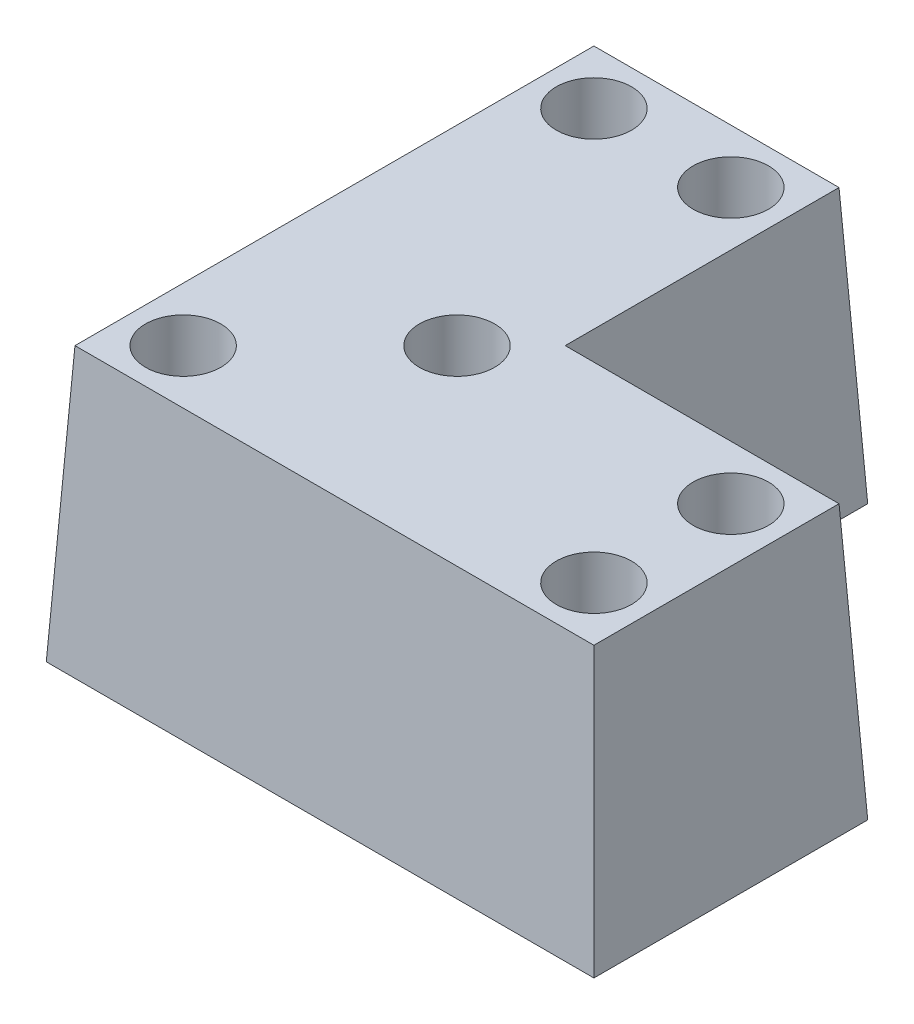
ISO-10303-21;
HEADER;
FILE_DESCRIPTION(('STEP AP214'),'2;1');
FILE_NAME('part.step','',(''),(''),'','','');
FILE_SCHEMA(('AUTOMOTIVE_DESIGN { 1 0 10303 214 1 1 1 1 }'));
ENDSEC;
DATA;
#1=APPLICATION_CONTEXT('core data for automotive mechanical design processes');
#2=APPLICATION_PROTOCOL_DEFINITION('international standard','automotive_design',2000,#1);
#3=PRODUCT_CONTEXT('',#1,'mechanical');
#4=PRODUCT('Part','Part','',(#3));
#5=PRODUCT_RELATED_PRODUCT_CATEGORY('part','',(#4));
#6=PRODUCT_DEFINITION_FORMATION('','',#4);
#7=PRODUCT_DEFINITION_CONTEXT('part definition',#1,'design');
#8=PRODUCT_DEFINITION('design','',#6,#7);
#9=PRODUCT_DEFINITION_SHAPE('','',#8);
#10=(LENGTH_UNIT() NAMED_UNIT(*) SI_UNIT(.MILLI.,.METRE.));
#11=(NAMED_UNIT(*) PLANE_ANGLE_UNIT() SI_UNIT($,.RADIAN.));
#12=(NAMED_UNIT(*) SI_UNIT($,.STERADIAN.) SOLID_ANGLE_UNIT());
#13=UNCERTAINTY_MEASURE_WITH_UNIT(LENGTH_MEASURE(1.E-05),#10,'distance_accuracy_value','');
#14=(GEOMETRIC_REPRESENTATION_CONTEXT(3) GLOBAL_UNCERTAINTY_ASSIGNED_CONTEXT((#13)) GLOBAL_UNIT_ASSIGNED_CONTEXT((#10,
#11,#12)) REPRESENTATION_CONTEXT('',''));
#15=CARTESIAN_POINT('',(0.,0.,0.));
#16=DIRECTION('',(0.,0.,1.));
#17=DIRECTION('',(1.,0.,0.));
#18=AXIS2_PLACEMENT_3D('',#15,#16,#17);
#19=CARTESIAN_POINT('',(0.,0.,0.));
#20=DIRECTION('',(-0.998629534754574,0.0523359562429439,0.));
#21=DIRECTION('',(-0.0523359562429439,-0.998629534754574,0.));
#22=AXIS2_PLACEMENT_3D('',#19,#20,#21);
#23=PLANE('',#22);
#24=DIRECTION('',(0.,0.,1.));
#25=VECTOR('',#24,1.);
#26=CARTESIAN_POINT('',(0.,0.,0.));
#27=LINE('',#26,#25);
#28=CARTESIAN_POINT('',(0.,0.,-80.));
#29=VERTEX_POINT('',#28);
#30=CARTESIAN_POINT('',(0.,0.,0.));
#31=VERTEX_POINT('',#30);
#32=EDGE_CURVE('E92',#29,#31,#27,.T.);
#33=ORIENTED_EDGE('',*,*,#32,.T.);
#34=DIRECTION('',(-0.052264427688714,-0.997264688634237,0.052264427688714));
#35=VECTOR('',#34,1.);
#36=CARTESIAN_POINT('',(0.,0.,0.));
#37=LINE('',#36,#35);
#38=CARTESIAN_POINT('',(2.09631117132165,40.,-2.09631117132165));
#39=VERTEX_POINT('',#38);
#40=EDGE_CURVE('E11',#39,#31,#37,.T.);
#41=ORIENTED_EDGE('',*,*,#40,.F.);
#42=DIRECTION('',(0.,0.,-1.));
#43=VECTOR('',#42,1.);
#44=CARTESIAN_POINT('',(2.09631117132165,40.,0.));
#45=LINE('',#44,#43);
#46=CARTESIAN_POINT('',(2.09631117132165,40.,-77.9036888286783));
#47=VERTEX_POINT('',#46);
#48=EDGE_CURVE('E118',#47,#39,#45,.F.);
#49=ORIENTED_EDGE('',*,*,#48,.F.);
#50=DIRECTION('',(-0.052264427688714,-0.997264688634237,-0.052264427688714));
#51=VECTOR('',#50,1.);
#52=CARTESIAN_POINT('',(0.218525632130305,4.16971745645056,-79.7814743678697));
#53=LINE('',#52,#51);
#54=EDGE_CURVE('E104',#47,#29,#53,.T.);
#55=ORIENTED_EDGE('',*,*,#54,.T.);
#56=EDGE_LOOP('',(#33,#41,#49,#55));
#57=FACE_BOUND('',#56,.T.);
#58=ADVANCED_FACE('F34',(#57),#23,.T.);
#59=CARTESIAN_POINT('',(0.,0.,0.));
#60=DIRECTION('',(0.,0.0523359562429439,0.998629534754574));
#61=DIRECTION('',(0.,-0.998629534754574,0.0523359562429439));
#62=AXIS2_PLACEMENT_3D('',#59,#60,#61);
#63=PLANE('',#62);
#64=DIRECTION('',(1.,0.,0.));
#65=VECTOR('',#64,1.);
#66=CARTESIAN_POINT('',(0.,0.,0.));
#67=LINE('',#66,#65);
#68=CARTESIAN_POINT('',(80.,0.,0.));
#69=VERTEX_POINT('',#68);
#70=EDGE_CURVE('E88',#31,#69,#67,.T.);
#71=ORIENTED_EDGE('',*,*,#70,.T.);
#72=DIRECTION('',(0.052264427688714,-0.997264688634237,0.052264427688714));
#73=VECTOR('',#72,1.);
#74=CARTESIAN_POINT('',(80.,0.,0.));
#75=LINE('',#74,#73);
#76=CARTESIAN_POINT('',(77.9036888286783,40.,-2.09631117132165));
#77=VERTEX_POINT('',#76);
#78=EDGE_CURVE('E43',#77,#69,#75,.T.);
#79=ORIENTED_EDGE('',*,*,#78,.F.);
#80=DIRECTION('',(-1.,0.,0.));
#81=VECTOR('',#80,1.);
#82=CARTESIAN_POINT('',(0.,40.,-2.09631117132165));
#83=LINE('',#82,#81);
#84=EDGE_CURVE('E100',#39,#77,#83,.F.);
#85=ORIENTED_EDGE('',*,*,#84,.F.);
#86=ORIENTED_EDGE('',*,*,#40,.T.);
#87=EDGE_LOOP('',(#71,#79,#85,#86));
#88=FACE_BOUND('',#87,.T.);
#89=ADVANCED_FACE('F36',(#88),#63,.T.);
#90=CARTESIAN_POINT('',(80.,0.,0.));
#91=DIRECTION('',(0.998629534754574,0.0523359562429439,0.));
#92=DIRECTION('',(-0.0523359562429439,0.998629534754574,0.));
#93=AXIS2_PLACEMENT_3D('',#90,#91,#92);
#94=PLANE('',#93);
#95=DIRECTION('',(0.,0.,-1.));
#96=VECTOR('',#95,1.);
#97=CARTESIAN_POINT('',(80.,0.,0.));
#98=LINE('',#97,#96);
#99=CARTESIAN_POINT('',(80.,0.,-40.));
#100=VERTEX_POINT('',#99);
#101=EDGE_CURVE('E94',#69,#100,#98,.T.);
#102=ORIENTED_EDGE('',*,*,#101,.T.);
#103=DIRECTION('',(0.052264427688714,-0.997264688634237,-0.052264427688714));
#104=VECTOR('',#103,1.);
#105=CARTESIAN_POINT('',(80.,0.,-40.));
#106=LINE('',#105,#104);
#107=CARTESIAN_POINT('',(77.9036888286783,40.,-37.9036888286784));
#108=VERTEX_POINT('',#107);
#109=EDGE_CURVE('E127',#108,#100,#106,.T.);
#110=ORIENTED_EDGE('',*,*,#109,.F.);
#111=DIRECTION('',(0.,0.,1.));
#112=VECTOR('',#111,1.);
#113=CARTESIAN_POINT('',(77.9036888286783,40.,0.));
#114=LINE('',#113,#112);
#115=EDGE_CURVE('E133',#77,#108,#114,.F.);
#116=ORIENTED_EDGE('',*,*,#115,.F.);
#117=ORIENTED_EDGE('',*,*,#78,.T.);
#118=EDGE_LOOP('',(#102,#110,#116,#117));
#119=FACE_BOUND('',#118,.T.);
#120=ADVANCED_FACE('F149',(#119),#94,.T.);
#121=CARTESIAN_POINT('',(80.,0.,-40.));
#122=DIRECTION('',(0.,0.0523359562429439,-0.998629534754574));
#123=DIRECTION('',(0.,0.998629534754574,0.0523359562429439));
#124=AXIS2_PLACEMENT_3D('',#121,#122,#123);
#125=PLANE('',#124);
#126=DIRECTION('',(-1.,0.,0.));
#127=VECTOR('',#126,1.);
#128=CARTESIAN_POINT('',(80.,0.,-40.));
#129=LINE('',#128,#127);
#130=CARTESIAN_POINT('',(40.,0.,-40.));
#131=VERTEX_POINT('',#130);
#132=EDGE_CURVE('E113',#100,#131,#129,.T.);
#133=ORIENTED_EDGE('',*,*,#132,.T.);
#134=DIRECTION('',(0.052264427688714,-0.997264688634237,-0.052264427688714));
#135=VECTOR('',#134,1.);
#136=CARTESIAN_POINT('',(40.1092628160652,-2.08485872822528,-40.1092628160652));
#137=LINE('',#136,#135);
#138=CARTESIAN_POINT('',(37.9036888286784,40.,-37.9036888286784));
#139=VERTEX_POINT('',#138);
#140=EDGE_CURVE('E124',#139,#131,#137,.T.);
#141=ORIENTED_EDGE('',*,*,#140,.F.);
#142=DIRECTION('',(1.,0.,0.));
#143=VECTOR('',#142,1.);
#144=CARTESIAN_POINT('',(0.,40.,-37.9036888286783));
#145=LINE('',#144,#143);
#146=EDGE_CURVE('E135',#108,#139,#145,.F.);
#147=ORIENTED_EDGE('',*,*,#146,.F.);
#148=ORIENTED_EDGE('',*,*,#109,.T.);
#149=EDGE_LOOP('',(#133,#141,#147,#148));
#150=FACE_BOUND('',#149,.T.);
#151=ADVANCED_FACE('F142',(#150),#125,.T.);
#152=CARTESIAN_POINT('',(40.,0.,-80.));
#153=DIRECTION('',(0.998629534754574,0.0523359562429439,0.));
#154=DIRECTION('',(-0.0523359562429439,0.998629534754574,0.));
#155=AXIS2_PLACEMENT_3D('',#152,#153,#154);
#156=PLANE('',#155);
#157=DIRECTION('',(0.,0.,-1.));
#158=VECTOR('',#157,1.);
#159=CARTESIAN_POINT('',(40.,0.,-80.));
#160=LINE('',#159,#158);
#161=CARTESIAN_POINT('',(40.,0.,-80.));
#162=VERTEX_POINT('',#161);
#163=EDGE_CURVE('E115',#131,#162,#160,.T.);
#164=ORIENTED_EDGE('',*,*,#163,.T.);
#165=DIRECTION('',(0.052264427688714,-0.997264688634237,-0.052264427688714));
#166=VECTOR('',#165,1.);
#167=CARTESIAN_POINT('',(39.8907371839348,2.08485872822528,-79.8907371839348));
#168=LINE('',#167,#166);
#169=CARTESIAN_POINT('',(37.9036888286784,40.,-77.9036888286783));
#170=VERTEX_POINT('',#169);
#171=EDGE_CURVE('E121',#170,#162,#168,.T.);
#172=ORIENTED_EDGE('',*,*,#171,.F.);
#173=DIRECTION('',(0.,0.,1.));
#174=VECTOR('',#173,1.);
#175=CARTESIAN_POINT('',(37.9036888286783,40.,0.));
#176=LINE('',#175,#174);
#177=EDGE_CURVE('E55',#139,#170,#176,.F.);
#178=ORIENTED_EDGE('',*,*,#177,.F.);
#179=ORIENTED_EDGE('',*,*,#140,.T.);
#180=EDGE_LOOP('',(#164,#172,#178,#179));
#181=FACE_BOUND('',#180,.T.);
#182=ADVANCED_FACE('F145',(#181),#156,.T.);
#183=CARTESIAN_POINT('',(0.,0.,-80.));
#184=DIRECTION('',(0.,0.0523359562429439,-0.998629534754574));
#185=DIRECTION('',(0.,0.998629534754574,0.0523359562429439));
#186=AXIS2_PLACEMENT_3D('',#183,#184,#185);
#187=PLANE('',#186);
#188=DIRECTION('',(-1.,0.,0.));
#189=VECTOR('',#188,1.);
#190=CARTESIAN_POINT('',(0.,0.,-80.));
#191=LINE('',#190,#189);
#192=EDGE_CURVE('E117',#162,#29,#191,.T.);
#193=ORIENTED_EDGE('',*,*,#192,.T.);
#194=ORIENTED_EDGE('',*,*,#54,.F.);
#195=DIRECTION('',(1.,0.,0.));
#196=VECTOR('',#195,1.);
#197=CARTESIAN_POINT('',(0.,40.,-77.9036888286783));
#198=LINE('',#197,#196);
#199=EDGE_CURVE('E38',#170,#47,#198,.F.);
#200=ORIENTED_EDGE('',*,*,#199,.F.);
#201=ORIENTED_EDGE('',*,*,#171,.T.);
#202=EDGE_LOOP('',(#193,#194,#200,#201));
#203=FACE_BOUND('',#202,.T.);
#204=ADVANCED_FACE('F147',(#203),#187,.T.);
#205=CARTESIAN_POINT('',(0.,40.,0.));
#206=DIRECTION('',(0.,-1.,0.));
#207=DIRECTION('',(0.,0.,-1.));
#208=AXIS2_PLACEMENT_3D('',#205,#206,#207);
#209=PLANE('',#208);
#210=CARTESIAN_POINT('',(10.,40.,-70.));
#211=DIRECTION('',(0.,1.,0.));
#212=DIRECTION('',(0.,0.,1.));
#213=AXIS2_PLACEMENT_3D('',#210,#211,#212);
#214=CIRCLE('',#213,5.49999999999999);
#215=CARTESIAN_POINT('',(10.,40.,-64.5));
#216=VERTEX_POINT('',#215);
#217=EDGE_CURVE('E400',#216,#216,#214,.T.);
#218=ORIENTED_EDGE('',*,*,#217,.F.);
#219=EDGE_LOOP('',(#218));
#220=FACE_BOUND('',#219,.T.);
#221=CARTESIAN_POINT('',(30.,40.,-70.));
#222=DIRECTION('',(0.,1.,0.));
#223=DIRECTION('',(0.,0.,1.));
#224=AXIS2_PLACEMENT_3D('',#221,#222,#223);
#225=CIRCLE('',#224,5.5);
#226=CARTESIAN_POINT('',(30.,40.,-64.5));
#227=VERTEX_POINT('',#226);
#228=EDGE_CURVE('E410',#227,#227,#225,.T.);
#229=ORIENTED_EDGE('',*,*,#228,.F.);
#230=EDGE_LOOP('',(#229));
#231=FACE_BOUND('',#230,.T.);
#232=CARTESIAN_POINT('',(70.,40.,-30.));
#233=DIRECTION('',(0.,1.,0.));
#234=DIRECTION('',(0.,0.,1.));
#235=AXIS2_PLACEMENT_3D('',#232,#233,#234);
#236=CIRCLE('',#235,5.49999999999999);
#237=CARTESIAN_POINT('',(70.,40.,-24.5));
#238=VERTEX_POINT('',#237);
#239=EDGE_CURVE('E422',#238,#238,#236,.T.);
#240=ORIENTED_EDGE('',*,*,#239,.F.);
#241=EDGE_LOOP('',(#240));
#242=FACE_BOUND('',#241,.T.);
#243=CARTESIAN_POINT('',(70.,40.,-9.99999999999999));
#244=DIRECTION('',(0.,1.,0.));
#245=DIRECTION('',(0.,0.,1.));
#246=AXIS2_PLACEMENT_3D('',#243,#244,#245);
#247=CIRCLE('',#246,5.49999999999999);
#248=CARTESIAN_POINT('',(70.,40.,-4.5));
#249=VERTEX_POINT('',#248);
#250=EDGE_CURVE('E434',#249,#249,#247,.T.);
#251=ORIENTED_EDGE('',*,*,#250,.F.);
#252=EDGE_LOOP('',(#251));
#253=FACE_BOUND('',#252,.T.);
#254=CARTESIAN_POINT('',(30.,40.,-30.));
#255=DIRECTION('',(0.,1.,0.));
#256=DIRECTION('',(0.,0.,1.));
#257=AXIS2_PLACEMENT_3D('',#254,#255,#256);
#258=CIRCLE('',#257,5.49999999999999);
#259=CARTESIAN_POINT('',(30.,40.,-24.5));
#260=VERTEX_POINT('',#259);
#261=EDGE_CURVE('E446',#260,#260,#258,.T.);
#262=ORIENTED_EDGE('',*,*,#261,.F.);
#263=EDGE_LOOP('',(#262));
#264=FACE_BOUND('',#263,.T.);
#265=CARTESIAN_POINT('',(10.,40.,-9.99999999999998));
#266=DIRECTION('',(0.,1.,0.));
#267=DIRECTION('',(0.,0.,1.));
#268=AXIS2_PLACEMENT_3D('',#265,#266,#267);
#269=CIRCLE('',#268,5.49999999999999);
#270=CARTESIAN_POINT('',(10.,40.,-4.49999999999998));
#271=VERTEX_POINT('',#270);
#272=EDGE_CURVE('E458',#271,#271,#269,.T.);
#273=ORIENTED_EDGE('',*,*,#272,.F.);
#274=EDGE_LOOP('',(#273));
#275=FACE_BOUND('',#274,.T.);
#276=ORIENTED_EDGE('',*,*,#48,.T.);
#277=ORIENTED_EDGE('',*,*,#84,.T.);
#278=ORIENTED_EDGE('',*,*,#115,.T.);
#279=ORIENTED_EDGE('',*,*,#146,.T.);
#280=ORIENTED_EDGE('',*,*,#177,.T.);
#281=ORIENTED_EDGE('',*,*,#199,.T.);
#282=EDGE_LOOP('',(#276,#277,#278,#279,#280,#281));
#283=FACE_BOUND('',#282,.T.);
#284=ADVANCED_FACE('F138',(#220,#231,#242,#253,#264,#275,#283),#209,.F.);
#285=CARTESIAN_POINT('',(0.,0.,0.));
#286=DIRECTION('',(0.,-1.,0.));
#287=DIRECTION('',(0.,0.,-1.));
#288=AXIS2_PLACEMENT_3D('',#285,#286,#287);
#289=PLANE('',#288);
#290=CARTESIAN_POINT('',(10.,0.,-70.));
#291=DIRECTION('',(0.,1.,0.));
#292=DIRECTION('',(0.,0.,1.));
#293=AXIS2_PLACEMENT_3D('',#290,#291,#292);
#294=CIRCLE('',#293,2.74999999999999);
#295=CARTESIAN_POINT('',(10.,0.,-67.25));
#296=VERTEX_POINT('',#295);
#297=EDGE_CURVE('E407',#296,#296,#294,.T.);
#298=ORIENTED_EDGE('',*,*,#297,.T.);
#299=EDGE_LOOP('',(#298));
#300=FACE_BOUND('',#299,.T.);
#301=CARTESIAN_POINT('',(30.,0.,-70.));
#302=DIRECTION('',(0.,1.,0.));
#303=DIRECTION('',(0.,0.,1.));
#304=AXIS2_PLACEMENT_3D('',#301,#302,#303);
#305=CIRCLE('',#304,2.74999999999999);
#306=CARTESIAN_POINT('',(30.,0.,-67.25));
#307=VERTEX_POINT('',#306);
#308=EDGE_CURVE('E419',#307,#307,#305,.T.);
#309=ORIENTED_EDGE('',*,*,#308,.T.);
#310=EDGE_LOOP('',(#309));
#311=FACE_BOUND('',#310,.T.);
#312=CARTESIAN_POINT('',(70.,0.,-30.));
#313=DIRECTION('',(0.,1.,0.));
#314=DIRECTION('',(0.,0.,1.));
#315=AXIS2_PLACEMENT_3D('',#312,#313,#314);
#316=CIRCLE('',#315,2.74999999999999);
#317=CARTESIAN_POINT('',(70.,0.,-27.25));
#318=VERTEX_POINT('',#317);
#319=EDGE_CURVE('E431',#318,#318,#316,.T.);
#320=ORIENTED_EDGE('',*,*,#319,.T.);
#321=EDGE_LOOP('',(#320));
#322=FACE_BOUND('',#321,.T.);
#323=CARTESIAN_POINT('',(70.,0.,-9.99999999999999));
#324=DIRECTION('',(0.,1.,0.));
#325=DIRECTION('',(0.,0.,1.));
#326=AXIS2_PLACEMENT_3D('',#323,#324,#325);
#327=CIRCLE('',#326,2.74999999999999);
#328=CARTESIAN_POINT('',(70.,0.,-7.25000000000001));
#329=VERTEX_POINT('',#328);
#330=EDGE_CURVE('E443',#329,#329,#327,.T.);
#331=ORIENTED_EDGE('',*,*,#330,.T.);
#332=EDGE_LOOP('',(#331));
#333=FACE_BOUND('',#332,.T.);
#334=CARTESIAN_POINT('',(30.,0.,-30.));
#335=DIRECTION('',(0.,1.,0.));
#336=DIRECTION('',(0.,0.,1.));
#337=AXIS2_PLACEMENT_3D('',#334,#335,#336);
#338=CIRCLE('',#337,2.74999999999999);
#339=CARTESIAN_POINT('',(30.,0.,-27.25));
#340=VERTEX_POINT('',#339);
#341=EDGE_CURVE('E455',#340,#340,#338,.T.);
#342=ORIENTED_EDGE('',*,*,#341,.T.);
#343=EDGE_LOOP('',(#342));
#344=FACE_BOUND('',#343,.T.);
#345=CARTESIAN_POINT('',(10.,0.,-9.99999999999998));
#346=DIRECTION('',(0.,1.,0.));
#347=DIRECTION('',(0.,0.,1.));
#348=AXIS2_PLACEMENT_3D('',#345,#346,#347);
#349=CIRCLE('',#348,2.74999999999999);
#350=CARTESIAN_POINT('',(10.,0.,-7.24999999999999));
#351=VERTEX_POINT('',#350);
#352=EDGE_CURVE('E105',#351,#351,#349,.T.);
#353=ORIENTED_EDGE('',*,*,#352,.T.);
#354=EDGE_LOOP('',(#353));
#355=FACE_BOUND('',#354,.T.);
#356=ORIENTED_EDGE('',*,*,#32,.F.);
#357=ORIENTED_EDGE('',*,*,#192,.F.);
#358=ORIENTED_EDGE('',*,*,#163,.F.);
#359=ORIENTED_EDGE('',*,*,#132,.F.);
#360=ORIENTED_EDGE('',*,*,#101,.F.);
#361=ORIENTED_EDGE('',*,*,#70,.F.);
#362=EDGE_LOOP('',(#356,#357,#358,#359,#360,#361));
#363=FACE_BOUND('',#362,.T.);
#364=ADVANCED_FACE('F89',(#300,#311,#322,#333,#344,#355,#363),#289,.T.);
#365=CARTESIAN_POINT('',(10.,40.,-9.99999999999998));
#366=DIRECTION('',(0.,1.,0.));
#367=DIRECTION('',(0.,0.,1.));
#368=AXIS2_PLACEMENT_3D('',#365,#366,#367);
#369=CYLINDRICAL_SURFACE('',#368,2.74999999999999);
#370=ORIENTED_EDGE('',*,*,#352,.F.);
#371=EDGE_LOOP('',(#370));
#372=FACE_BOUND('',#371,.T.);
#373=CARTESIAN_POINT('',(10.,5.,-9.99999999999998));
#374=DIRECTION('',(0.,1.,0.));
#375=DIRECTION('',(0.,0.,1.));
#376=AXIS2_PLACEMENT_3D('',#373,#374,#375);
#377=CIRCLE('',#376,2.74999999999999);
#378=CARTESIAN_POINT('',(10.,5.,-7.24999999999999));
#379=VERTEX_POINT('',#378);
#380=EDGE_CURVE('E108',#379,#379,#377,.T.);
#381=ORIENTED_EDGE('',*,*,#380,.T.);
#382=EDGE_LOOP('',(#381));
#383=FACE_BOUND('',#382,.T.);
#384=ADVANCED_FACE('F186',(#372,#383),#369,.F.);
#385=CARTESIAN_POINT('',(12.75,5.,-9.99999999999998));
#386=DIRECTION('',(0.,-1.,0.));
#387=DIRECTION('',(0.,0.,-1.));
#388=AXIS2_PLACEMENT_3D('',#385,#386,#387);
#389=PLANE('',#388);
#390=ORIENTED_EDGE('',*,*,#380,.F.);
#391=EDGE_LOOP('',(#390));
#392=FACE_BOUND('',#391,.T.);
#393=CARTESIAN_POINT('',(10.,5.,-9.99999999999998));
#394=DIRECTION('',(0.,1.,0.));
#395=DIRECTION('',(0.,0.,1.));
#396=AXIS2_PLACEMENT_3D('',#393,#394,#395);
#397=CIRCLE('',#396,5.49999999999999);
#398=CARTESIAN_POINT('',(10.,5.,-4.49999999999999));
#399=VERTEX_POINT('',#398);
#400=EDGE_CURVE('E461',#399,#399,#397,.T.);
#401=ORIENTED_EDGE('',*,*,#400,.T.);
#402=EDGE_LOOP('',(#401));
#403=FACE_BOUND('',#402,.T.);
#404=ADVANCED_FACE('F193',(#392,#403),#389,.F.);
#405=CARTESIAN_POINT('',(10.,40.,-9.99999999999998));
#406=DIRECTION('',(0.,1.,0.));
#407=DIRECTION('',(0.,0.,1.));
#408=AXIS2_PLACEMENT_3D('',#405,#406,#407);
#409=CYLINDRICAL_SURFACE('',#408,5.49999999999999);
#410=ORIENTED_EDGE('',*,*,#400,.F.);
#411=EDGE_LOOP('',(#410));
#412=FACE_BOUND('',#411,.T.);
#413=ORIENTED_EDGE('',*,*,#272,.T.);
#414=EDGE_LOOP('',(#413));
#415=FACE_BOUND('',#414,.T.);
#416=ADVANCED_FACE('F201',(#412,#415),#409,.F.);
#417=CARTESIAN_POINT('',(30.,40.,-30.));
#418=DIRECTION('',(0.,1.,0.));
#419=DIRECTION('',(0.,0.,1.));
#420=AXIS2_PLACEMENT_3D('',#417,#418,#419);
#421=CYLINDRICAL_SURFACE('',#420,2.74999999999999);
#422=ORIENTED_EDGE('',*,*,#341,.F.);
#423=EDGE_LOOP('',(#422));
#424=FACE_BOUND('',#423,.T.);
#425=CARTESIAN_POINT('',(30.,5.,-30.));
#426=DIRECTION('',(0.,1.,0.));
#427=DIRECTION('',(0.,0.,1.));
#428=AXIS2_PLACEMENT_3D('',#425,#426,#427);
#429=CIRCLE('',#428,2.74999999999999);
#430=CARTESIAN_POINT('',(30.,5.,-27.25));
#431=VERTEX_POINT('',#430);
#432=EDGE_CURVE('E452',#431,#431,#429,.T.);
#433=ORIENTED_EDGE('',*,*,#432,.T.);
#434=EDGE_LOOP('',(#433));
#435=FACE_BOUND('',#434,.T.);
#436=ADVANCED_FACE('F209',(#424,#435),#421,.F.);
#437=CARTESIAN_POINT('',(32.75,5.,-30.));
#438=DIRECTION('',(0.,-1.,0.));
#439=DIRECTION('',(0.,0.,-1.));
#440=AXIS2_PLACEMENT_3D('',#437,#438,#439);
#441=PLANE('',#440);
#442=ORIENTED_EDGE('',*,*,#432,.F.);
#443=EDGE_LOOP('',(#442));
#444=FACE_BOUND('',#443,.T.);
#445=CARTESIAN_POINT('',(30.,5.,-30.));
#446=DIRECTION('',(0.,1.,0.));
#447=DIRECTION('',(0.,0.,1.));
#448=AXIS2_PLACEMENT_3D('',#445,#446,#447);
#449=CIRCLE('',#448,5.49999999999999);
#450=CARTESIAN_POINT('',(30.,5.,-24.5));
#451=VERTEX_POINT('',#450);
#452=EDGE_CURVE('E449',#451,#451,#449,.T.);
#453=ORIENTED_EDGE('',*,*,#452,.T.);
#454=EDGE_LOOP('',(#453));
#455=FACE_BOUND('',#454,.T.);
#456=ADVANCED_FACE('F217',(#444,#455),#441,.F.);
#457=CARTESIAN_POINT('',(30.,40.,-30.));
#458=DIRECTION('',(0.,1.,0.));
#459=DIRECTION('',(0.,0.,1.));
#460=AXIS2_PLACEMENT_3D('',#457,#458,#459);
#461=CYLINDRICAL_SURFACE('',#460,5.49999999999999);
#462=ORIENTED_EDGE('',*,*,#452,.F.);
#463=EDGE_LOOP('',(#462));
#464=FACE_BOUND('',#463,.T.);
#465=ORIENTED_EDGE('',*,*,#261,.T.);
#466=EDGE_LOOP('',(#465));
#467=FACE_BOUND('',#466,.T.);
#468=ADVANCED_FACE('F225',(#464,#467),#461,.F.);
#469=CARTESIAN_POINT('',(70.,40.,-9.99999999999999));
#470=DIRECTION('',(0.,1.,0.));
#471=DIRECTION('',(0.,0.,1.));
#472=AXIS2_PLACEMENT_3D('',#469,#470,#471);
#473=CYLINDRICAL_SURFACE('',#472,2.74999999999999);
#474=ORIENTED_EDGE('',*,*,#330,.F.);
#475=EDGE_LOOP('',(#474));
#476=FACE_BOUND('',#475,.T.);
#477=CARTESIAN_POINT('',(70.,5.,-9.99999999999999));
#478=DIRECTION('',(0.,1.,0.));
#479=DIRECTION('',(0.,0.,1.));
#480=AXIS2_PLACEMENT_3D('',#477,#478,#479);
#481=CIRCLE('',#480,2.74999999999999);
#482=CARTESIAN_POINT('',(70.,5.,-7.25000000000001));
#483=VERTEX_POINT('',#482);
#484=EDGE_CURVE('E440',#483,#483,#481,.T.);
#485=ORIENTED_EDGE('',*,*,#484,.T.);
#486=EDGE_LOOP('',(#485));
#487=FACE_BOUND('',#486,.T.);
#488=ADVANCED_FACE('F233',(#476,#487),#473,.F.);
#489=CARTESIAN_POINT('',(72.75,5.,-9.99999999999999));
#490=DIRECTION('',(0.,-1.,0.));
#491=DIRECTION('',(0.,0.,-1.));
#492=AXIS2_PLACEMENT_3D('',#489,#490,#491);
#493=PLANE('',#492);
#494=ORIENTED_EDGE('',*,*,#484,.F.);
#495=EDGE_LOOP('',(#494));
#496=FACE_BOUND('',#495,.T.);
#497=CARTESIAN_POINT('',(70.,5.,-9.99999999999999));
#498=DIRECTION('',(0.,1.,0.));
#499=DIRECTION('',(0.,0.,1.));
#500=AXIS2_PLACEMENT_3D('',#497,#498,#499);
#501=CIRCLE('',#500,5.49999999999999);
#502=CARTESIAN_POINT('',(70.,5.,-4.5));
#503=VERTEX_POINT('',#502);
#504=EDGE_CURVE('E437',#503,#503,#501,.T.);
#505=ORIENTED_EDGE('',*,*,#504,.T.);
#506=EDGE_LOOP('',(#505));
#507=FACE_BOUND('',#506,.T.);
#508=ADVANCED_FACE('F241',(#496,#507),#493,.F.);
#509=CARTESIAN_POINT('',(70.,40.,-9.99999999999999));
#510=DIRECTION('',(0.,1.,0.));
#511=DIRECTION('',(0.,0.,1.));
#512=AXIS2_PLACEMENT_3D('',#509,#510,#511);
#513=CYLINDRICAL_SURFACE('',#512,5.49999999999999);
#514=ORIENTED_EDGE('',*,*,#504,.F.);
#515=EDGE_LOOP('',(#514));
#516=FACE_BOUND('',#515,.T.);
#517=ORIENTED_EDGE('',*,*,#250,.T.);
#518=EDGE_LOOP('',(#517));
#519=FACE_BOUND('',#518,.T.);
#520=ADVANCED_FACE('F249',(#516,#519),#513,.F.);
#521=CARTESIAN_POINT('',(70.,40.,-30.));
#522=DIRECTION('',(0.,1.,0.));
#523=DIRECTION('',(0.,0.,1.));
#524=AXIS2_PLACEMENT_3D('',#521,#522,#523);
#525=CYLINDRICAL_SURFACE('',#524,2.74999999999999);
#526=ORIENTED_EDGE('',*,*,#319,.F.);
#527=EDGE_LOOP('',(#526));
#528=FACE_BOUND('',#527,.T.);
#529=CARTESIAN_POINT('',(70.,5.,-30.));
#530=DIRECTION('',(0.,1.,0.));
#531=DIRECTION('',(0.,0.,1.));
#532=AXIS2_PLACEMENT_3D('',#529,#530,#531);
#533=CIRCLE('',#532,2.74999999999999);
#534=CARTESIAN_POINT('',(70.,5.,-27.25));
#535=VERTEX_POINT('',#534);
#536=EDGE_CURVE('E428',#535,#535,#533,.T.);
#537=ORIENTED_EDGE('',*,*,#536,.T.);
#538=EDGE_LOOP('',(#537));
#539=FACE_BOUND('',#538,.T.);
#540=ADVANCED_FACE('F257',(#528,#539),#525,.F.);
#541=CARTESIAN_POINT('',(72.75,5.,-30.));
#542=DIRECTION('',(0.,-1.,0.));
#543=DIRECTION('',(0.,0.,-1.));
#544=AXIS2_PLACEMENT_3D('',#541,#542,#543);
#545=PLANE('',#544);
#546=ORIENTED_EDGE('',*,*,#536,.F.);
#547=EDGE_LOOP('',(#546));
#548=FACE_BOUND('',#547,.T.);
#549=CARTESIAN_POINT('',(70.,5.,-30.));
#550=DIRECTION('',(0.,1.,0.));
#551=DIRECTION('',(0.,0.,1.));
#552=AXIS2_PLACEMENT_3D('',#549,#550,#551);
#553=CIRCLE('',#552,5.49999999999999);
#554=CARTESIAN_POINT('',(70.,5.,-24.5));
#555=VERTEX_POINT('',#554);
#556=EDGE_CURVE('E425',#555,#555,#553,.T.);
#557=ORIENTED_EDGE('',*,*,#556,.T.);
#558=EDGE_LOOP('',(#557));
#559=FACE_BOUND('',#558,.T.);
#560=ADVANCED_FACE('F265',(#548,#559),#545,.F.);
#561=CARTESIAN_POINT('',(70.,40.,-30.));
#562=DIRECTION('',(0.,1.,0.));
#563=DIRECTION('',(0.,0.,1.));
#564=AXIS2_PLACEMENT_3D('',#561,#562,#563);
#565=CYLINDRICAL_SURFACE('',#564,5.49999999999999);
#566=ORIENTED_EDGE('',*,*,#556,.F.);
#567=EDGE_LOOP('',(#566));
#568=FACE_BOUND('',#567,.T.);
#569=ORIENTED_EDGE('',*,*,#239,.T.);
#570=EDGE_LOOP('',(#569));
#571=FACE_BOUND('',#570,.T.);
#572=ADVANCED_FACE('F273',(#568,#571),#565,.F.);
#573=CARTESIAN_POINT('',(30.,40.,-70.));
#574=DIRECTION('',(0.,1.,0.));
#575=DIRECTION('',(0.,0.,1.));
#576=AXIS2_PLACEMENT_3D('',#573,#574,#575);
#577=CYLINDRICAL_SURFACE('',#576,2.74999999999999);
#578=ORIENTED_EDGE('',*,*,#308,.F.);
#579=EDGE_LOOP('',(#578));
#580=FACE_BOUND('',#579,.T.);
#581=CARTESIAN_POINT('',(30.,5.,-70.));
#582=DIRECTION('',(0.,1.,0.));
#583=DIRECTION('',(0.,0.,1.));
#584=AXIS2_PLACEMENT_3D('',#581,#582,#583);
#585=CIRCLE('',#584,2.74999999999999);
#586=CARTESIAN_POINT('',(30.,5.,-67.25));
#587=VERTEX_POINT('',#586);
#588=EDGE_CURVE('E416',#587,#587,#585,.T.);
#589=ORIENTED_EDGE('',*,*,#588,.T.);
#590=EDGE_LOOP('',(#589));
#591=FACE_BOUND('',#590,.T.);
#592=ADVANCED_FACE('F281',(#580,#591),#577,.F.);
#593=CARTESIAN_POINT('',(32.75,5.,-70.));
#594=DIRECTION('',(0.,-1.,0.));
#595=DIRECTION('',(0.,0.,-1.));
#596=AXIS2_PLACEMENT_3D('',#593,#594,#595);
#597=PLANE('',#596);
#598=ORIENTED_EDGE('',*,*,#588,.F.);
#599=EDGE_LOOP('',(#598));
#600=FACE_BOUND('',#599,.T.);
#601=CARTESIAN_POINT('',(30.,5.,-70.));
#602=DIRECTION('',(0.,1.,0.));
#603=DIRECTION('',(0.,0.,1.));
#604=AXIS2_PLACEMENT_3D('',#601,#602,#603);
#605=CIRCLE('',#604,5.49999999999999);
#606=CARTESIAN_POINT('',(30.,5.,-64.5));
#607=VERTEX_POINT('',#606);
#608=EDGE_CURVE('E413',#607,#607,#605,.T.);
#609=ORIENTED_EDGE('',*,*,#608,.T.);
#610=EDGE_LOOP('',(#609));
#611=FACE_BOUND('',#610,.T.);
#612=ADVANCED_FACE('F289',(#600,#611),#597,.F.);
#613=CARTESIAN_POINT('',(30.,40.,-70.));
#614=DIRECTION('',(0.,1.,0.));
#615=DIRECTION('',(0.,0.,1.));
#616=AXIS2_PLACEMENT_3D('',#613,#614,#615);
#617=CYLINDRICAL_SURFACE('',#616,5.49999999999999);
#618=ORIENTED_EDGE('',*,*,#608,.F.);
#619=EDGE_LOOP('',(#618));
#620=FACE_BOUND('',#619,.T.);
#621=ORIENTED_EDGE('',*,*,#228,.T.);
#622=EDGE_LOOP('',(#621));
#623=FACE_BOUND('',#622,.T.);
#624=ADVANCED_FACE('F297',(#620,#623),#617,.F.);
#625=CARTESIAN_POINT('',(10.,40.,-70.));
#626=DIRECTION('',(0.,1.,0.));
#627=DIRECTION('',(0.,0.,1.));
#628=AXIS2_PLACEMENT_3D('',#625,#626,#627);
#629=CYLINDRICAL_SURFACE('',#628,2.74999999999999);
#630=ORIENTED_EDGE('',*,*,#297,.F.);
#631=EDGE_LOOP('',(#630));
#632=FACE_BOUND('',#631,.T.);
#633=CARTESIAN_POINT('',(10.,5.,-70.));
#634=DIRECTION('',(0.,1.,0.));
#635=DIRECTION('',(0.,0.,1.));
#636=AXIS2_PLACEMENT_3D('',#633,#634,#635);
#637=CIRCLE('',#636,2.74999999999999);
#638=CARTESIAN_POINT('',(10.,5.,-67.25));
#639=VERTEX_POINT('',#638);
#640=EDGE_CURVE('E402',#639,#639,#637,.T.);
#641=ORIENTED_EDGE('',*,*,#640,.T.);
#642=EDGE_LOOP('',(#641));
#643=FACE_BOUND('',#642,.T.);
#644=ADVANCED_FACE('F305',(#632,#643),#629,.F.);
#645=CARTESIAN_POINT('',(12.75,5.,-70.));
#646=DIRECTION('',(0.,-1.,0.));
#647=DIRECTION('',(0.,0.,-1.));
#648=AXIS2_PLACEMENT_3D('',#645,#646,#647);
#649=PLANE('',#648);
#650=ORIENTED_EDGE('',*,*,#640,.F.);
#651=EDGE_LOOP('',(#650));
#652=FACE_BOUND('',#651,.T.);
#653=CARTESIAN_POINT('',(10.,5.,-70.));
#654=DIRECTION('',(0.,1.,0.));
#655=DIRECTION('',(0.,0.,1.));
#656=AXIS2_PLACEMENT_3D('',#653,#654,#655);
#657=CIRCLE('',#656,5.49999999999999);
#658=CARTESIAN_POINT('',(10.,5.,-64.5));
#659=VERTEX_POINT('',#658);
#660=EDGE_CURVE('E397',#659,#659,#657,.T.);
#661=ORIENTED_EDGE('',*,*,#660,.T.);
#662=EDGE_LOOP('',(#661));
#663=FACE_BOUND('',#662,.T.);
#664=ADVANCED_FACE('F313',(#652,#663),#649,.F.);
#665=CARTESIAN_POINT('',(10.,40.,-70.));
#666=DIRECTION('',(0.,1.,0.));
#667=DIRECTION('',(0.,0.,1.));
#668=AXIS2_PLACEMENT_3D('',#665,#666,#667);
#669=CYLINDRICAL_SURFACE('',#668,5.49999999999999);
#670=ORIENTED_EDGE('',*,*,#660,.F.);
#671=EDGE_LOOP('',(#670));
#672=FACE_BOUND('',#671,.T.);
#673=ORIENTED_EDGE('',*,*,#217,.T.);
#674=EDGE_LOOP('',(#673));
#675=FACE_BOUND('',#674,.T.);
#676=ADVANCED_FACE('F321',(#672,#675),#669,.F.);
#677=CLOSED_SHELL('',(#58,#89,#120,#151,#182,#204,#284,#364,#384,#404,#416,#436,#456,#468,#488,
#508,#520,#540,#560,#572,#592,#612,#624,#644,#664,#676));
#678=MANIFOLD_SOLID_BREP('B2',#677);
#679=ADVANCED_BREP_SHAPE_REPRESENTATION('',(#18,#678),#14);
#680=SHAPE_DEFINITION_REPRESENTATION(#9,#679);
ENDSEC;
END-ISO-10303-21;
